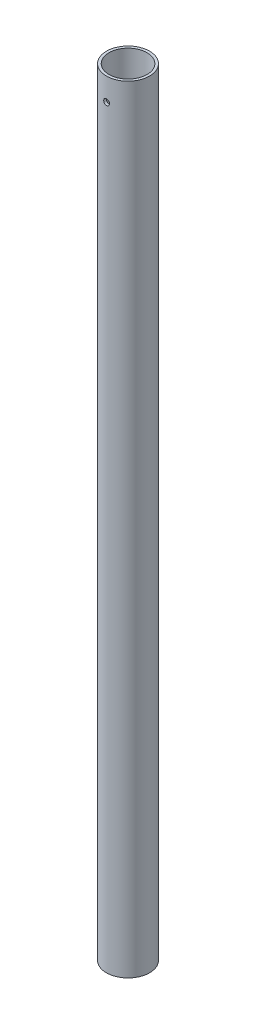
ISO-10303-21;
HEADER;
FILE_DESCRIPTION(('STEP AP214'),'2;1');
FILE_NAME('part.step','',(''),(''),'','','');
FILE_SCHEMA(('AUTOMOTIVE_DESIGN { 1 0 10303 214 1 1 1 1 }'));
ENDSEC;
DATA;
#1=APPLICATION_CONTEXT('core data for automotive mechanical design processes');
#2=APPLICATION_PROTOCOL_DEFINITION('international standard','automotive_design',2000,#1);
#3=PRODUCT_CONTEXT('',#1,'mechanical');
#4=PRODUCT('Part','Part','',(#3));
#5=PRODUCT_RELATED_PRODUCT_CATEGORY('part','',(#4));
#6=PRODUCT_DEFINITION_FORMATION('','',#4);
#7=PRODUCT_DEFINITION_CONTEXT('part definition',#1,'design');
#8=PRODUCT_DEFINITION('design','',#6,#7);
#9=PRODUCT_DEFINITION_SHAPE('','',#8);
#10=(LENGTH_UNIT() NAMED_UNIT(*) SI_UNIT(.MILLI.,.METRE.));
#11=(NAMED_UNIT(*) PLANE_ANGLE_UNIT() SI_UNIT($,.RADIAN.));
#12=(NAMED_UNIT(*) SI_UNIT($,.STERADIAN.) SOLID_ANGLE_UNIT());
#13=UNCERTAINTY_MEASURE_WITH_UNIT(LENGTH_MEASURE(1.E-05),#10,'distance_accuracy_value','');
#14=(GEOMETRIC_REPRESENTATION_CONTEXT(3) GLOBAL_UNCERTAINTY_ASSIGNED_CONTEXT((#13)) GLOBAL_UNIT_ASSIGNED_CONTEXT((#10,
#11,#12)) REPRESENTATION_CONTEXT('',''));
#15=CARTESIAN_POINT('',(0.,0.,0.));
#16=DIRECTION('',(0.,0.,1.));
#17=DIRECTION('',(1.,0.,0.));
#18=AXIS2_PLACEMENT_3D('',#15,#16,#17);
#19=CARTESIAN_POINT('',(0.,914.4,0.));
#20=DIRECTION('',(0.,-1.,0.));
#21=DIRECTION('',(0.,0.,-1.));
#22=AXIS2_PLACEMENT_3D('',#19,#20,#21);
#23=CYLINDRICAL_SURFACE('',#22,22.352);
#24=CARTESIAN_POINT('',(0.,0.,0.));
#25=DIRECTION('',(0.,-1.,0.));
#26=DIRECTION('',(0.,0.,-1.));
#27=AXIS2_PLACEMENT_3D('',#24,#25,#26);
#28=CIRCLE('',#27,22.352);
#29=CARTESIAN_POINT('',(0.,0.,-22.352));
#30=VERTEX_POINT('',#29);
#31=EDGE_CURVE('E58',#30,#30,#28,.T.);
#32=ORIENTED_EDGE('',*,*,#31,.T.);
#33=EDGE_LOOP('',(#32));
#34=FACE_BOUND('',#33,.T.);
#35=CARTESIAN_POINT('',(0.,891.2352,22.352));
#36=CARTESIAN_POINT('',(-0.192787800331613,891.235191670226,22.3519966817372));
#37=CARTESIAN_POINT('',(-0.385696921882685,891.219005278297,22.3494794771306));
#38=CARTESIAN_POINT('',(-0.766131020378442,891.154702321744,22.3396792596899));
#39=CARTESIAN_POINT('',(-0.95365010288195,891.106552091801,22.3323912221772));
#40=CARTESIAN_POINT('',(-1.31772767558845,890.979797747822,22.3138679603751));
#41=CARTESIAN_POINT('',(-1.49429473284724,890.901217794604,22.3026358682736));
#42=CARTESIAN_POINT('',(-1.83170153364577,890.715897565234,22.2774646791974));
#43=CARTESIAN_POINT('',(-1.99254418053206,890.609162501138,22.2635260833747));
#44=CARTESIAN_POINT('',(-2.2952912959751,890.369631083722,22.2343624585199));
#45=CARTESIAN_POINT('',(-2.43704860919259,890.236649784972,22.2191287642589));
#46=CARTESIAN_POINT('',(-2.69636219266557,889.948759356853,22.1891554805789));
#47=CARTESIAN_POINT('',(-2.81391175083711,889.793844165913,22.1744160291445));
#48=CARTESIAN_POINT('',(-3.02205947251266,889.465452233072,22.1470128358336));
#49=CARTESIAN_POINT('',(-3.11250089132633,889.291875137706,22.1343613490768));
#50=CARTESIAN_POINT('',(-3.26279668694624,888.931885333036,22.1127085726575));
#51=CARTESIAN_POINT('',(-3.3226854046329,888.745487303036,22.1037031871805));
#52=CARTESIAN_POINT('',(-3.3956301059032,888.428539200665,22.0925875651964));
#53=CARTESIAN_POINT('',(-3.41763647502503,888.300023006714,22.0891803484933));
#54=CARTESIAN_POINT('',(-3.44702415621325,888.041289669816,22.0846133585234));
#55=CARTESIAN_POINT('',(-3.45440563819527,887.911072546649,22.0834535591455));
#56=CARTESIAN_POINT('',(-3.4543916568152,887.588027689371,22.083459372483));
#57=CARTESIAN_POINT('',(-3.43820777823989,887.395134018256,22.086007580993));
#58=CARTESIAN_POINT('',(-3.37391571400562,887.014732032398,22.0959184684352));
#59=CARTESIAN_POINT('',(-3.32577381014417,886.827229624085,22.103286232253));
#60=CARTESIAN_POINT('',(-3.19904381395493,886.463187323993,22.1219822351445));
#61=CARTESIAN_POINT('',(-3.12048027431732,886.286638724594,22.1333072796588));
#62=CARTESIAN_POINT('',(-2.93519871600419,885.949262942106,22.1586374506396));
#63=CARTESIAN_POINT('',(-2.82848586996744,885.788432878056,22.1726420845823));
#64=CARTESIAN_POINT('',(-2.58897705366211,885.485671934179,22.2018856503502));
#65=CARTESIAN_POINT('',(-2.45599116183172,885.343892106742,22.2171330642284));
#66=CARTESIAN_POINT('',(-2.16808204690628,885.084534956294,22.2470723479777));
#67=CARTESIAN_POINT('',(-2.01315282192278,884.966964276573,22.2617640644582));
#68=CARTESIAN_POINT('',(-1.68474825740002,884.75879419673,22.2890287927131));
#69=CARTESIAN_POINT('',(-1.51117498187741,884.668347734429,22.3015896233344));
#70=CARTESIAN_POINT('',(-1.15119343144948,884.518041522809,22.3230606357152));
#71=CARTESIAN_POINT('',(-0.96479980232436,884.458147508401,22.3319749049221));
#72=CARTESIAN_POINT('',(-0.647837597429979,884.38518784625,22.3429724921967));
#73=CARTESIAN_POINT('',(-0.519301668870918,884.363174711376,22.3463414072399));
#74=CARTESIAN_POINT('',(-0.260528952017654,884.333778054954,22.3508562700568));
#75=CARTESIAN_POINT('',(-0.130292182682782,884.326394370472,22.3520022425885));
#76=CARTESIAN_POINT('',(0.192787800331615,884.326408329774,22.3519966817372));
#77=CARTESIAN_POINT('',(0.385696921882688,884.342594721703,22.3494794771306));
#78=CARTESIAN_POINT('',(0.766131020378447,884.406897678256,22.3396792596899));
#79=CARTESIAN_POINT('',(0.953650102881956,884.455047908199,22.3323912221772));
#80=CARTESIAN_POINT('',(1.31772767558846,884.581802252178,22.3138679603751));
#81=CARTESIAN_POINT('',(1.49429473284724,884.660382205397,22.3026358682736));
#82=CARTESIAN_POINT('',(1.83170153364578,884.845702434766,22.2774646791974));
#83=CARTESIAN_POINT('',(1.99254418053206,884.952437498863,22.2635260833747));
#84=CARTESIAN_POINT('',(2.29529129597509,885.191968916279,22.2343624585199));
#85=CARTESIAN_POINT('',(2.43704860919259,885.324950215028,22.2191287642589));
#86=CARTESIAN_POINT('',(2.69636219266557,885.612840643147,22.1891554805789));
#87=CARTESIAN_POINT('',(2.81391175083711,885.767755834087,22.1744160291445));
#88=CARTESIAN_POINT('',(3.02205947251267,886.096147766929,22.1470128358336));
#89=CARTESIAN_POINT('',(3.11250089132636,886.269724862294,22.1343613490768));
#90=CARTESIAN_POINT('',(3.26279668694625,886.629714666964,22.1127085726575));
#91=CARTESIAN_POINT('',(3.3226854046329,886.816112696965,22.1037031871805));
#92=CARTESIAN_POINT('',(3.39563010590318,887.133060799336,22.0925875651964));
#93=CARTESIAN_POINT('',(3.417636475025,887.261576993287,22.0891803484933));
#94=CARTESIAN_POINT('',(3.44702415621323,887.520310330184,22.0846133585234));
#95=CARTESIAN_POINT('',(3.45440563819526,887.650527453351,22.0834535591455));
#96=CARTESIAN_POINT('',(3.45439165681519,887.97357231063,22.083459372483));
#97=CARTESIAN_POINT('',(3.43820777823988,888.166465981744,22.086007580993));
#98=CARTESIAN_POINT('',(3.37391571400561,888.546867967603,22.0959184684352));
#99=CARTESIAN_POINT('',(3.32577381014417,888.734370375915,22.103286232253));
#100=CARTESIAN_POINT('',(3.1990438139549,889.098412676007,22.1219822351445));
#101=CARTESIAN_POINT('',(3.12048027431725,889.274961275407,22.1333072796588));
#102=CARTESIAN_POINT('',(2.9351987160041,889.612337057895,22.1586374506396));
#103=CARTESIAN_POINT('',(2.8284858699674,889.773167121944,22.1726420845823));
#104=CARTESIAN_POINT('',(2.58897705366211,890.075928065821,22.2018856503502));
#105=CARTESIAN_POINT('',(2.45599116183171,890.217707893258,22.2171330642284));
#106=CARTESIAN_POINT('',(2.16808204690627,890.477065043706,22.2470723479777));
#107=CARTESIAN_POINT('',(2.01315282192277,890.594635723427,22.2617640644582));
#108=CARTESIAN_POINT('',(1.68474825740001,890.802805803271,22.2890287927131));
#109=CARTESIAN_POINT('',(1.51117498187741,890.893252265571,22.3015896233344));
#110=CARTESIAN_POINT('',(1.15119343144947,891.043558477191,22.3230606357152));
#111=CARTESIAN_POINT('',(0.964799802324353,891.103452491599,22.3319749049221));
#112=CARTESIAN_POINT('',(0.647837597429972,891.17641215375,22.3429724921967));
#113=CARTESIAN_POINT('',(0.519301668870912,891.198425288625,22.3463414072399));
#114=CARTESIAN_POINT('',(0.260528952017652,891.227821945046,22.3508562700568));
#115=CARTESIAN_POINT('',(0.130292182682782,891.235205629529,22.3520022425885));
#116=CARTESIAN_POINT('',(0.,891.2352,22.352));
#117=B_SPLINE_CURVE_WITH_KNOTS('',3,(#35,#36,#37,#38,#39,#40,#41,#42,#43,#44,#45,#46,#47,#48,
#49,#50,#51,#52,#53,#54,#55,#56,#57,#58,#59,#60,#61,#62,#63,#64,#65,#66,#67,#68,#69,#70,#71,#72,
#73,#74,#75,#76,#77,#78,#79,#80,#81,#82,#83,#84,#85,#86,#87,#88,#89,#90,#91,#92,#93,#94,#95,#96,
#97,#98,#99,#100,#101,#102,#103,#104,#105,#106,#107,#108,#109,#110,#111,#112,#113,#114,#115,
#116),.UNSPECIFIED.,.T.,.F.,(4,2,2,2,2,2,2,2,2,2,2,2,2,2,2,2,2,2,2,2,2,2,2,2,2,2,2,2,2,2,2,2,2,
2,2,2,2,2,2,2,4),(0.,0.577885934660606,1.15638148469218,1.73441865517966,2.31234889482481,
2.89450712845753,3.47682656041288,4.06245085625192,4.6474154588892,5.0379149199601,
5.42840984408317,6.00624923349245,6.58469925945742,7.16268339984174,7.74056140535436,
8.32278059459881,8.90515933969419,9.49076257833453,10.0757076010334,10.4662658118655,
10.8568196728416,11.4347056075022,12.0132011575338,12.5912383280213,13.1691685676664,
13.7513268012991,14.3336462332545,14.9192705290936,15.5042351317308,15.8947345928015,
16.2852295169248,16.863068906334,17.441518932299,18.0195030726835,18.597381078196,
19.1796002674404,19.7619790125358,20.3475822511761,20.932527273875,21.3230854847071,
21.7136393456832),.UNSPECIFIED.);
#118=CARTESIAN_POINT('',(0.,891.2352,22.352));
#119=VERTEX_POINT('',#118);
#120=EDGE_CURVE('E61',#119,#119,#117,.T.);
#121=ORIENTED_EDGE('',*,*,#120,.T.);
#122=EDGE_LOOP('',(#121));
#123=FACE_BOUND('',#122,.T.);
#124=CARTESIAN_POINT('',(0.,914.4,0.));
#125=DIRECTION('',(0.,-1.,0.));
#126=DIRECTION('',(0.,0.,-1.));
#127=AXIS2_PLACEMENT_3D('',#124,#125,#126);
#128=CIRCLE('',#127,22.352);
#129=CARTESIAN_POINT('',(0.,914.4,-22.352));
#130=VERTEX_POINT('',#129);
#131=EDGE_CURVE('E19',#130,#130,#128,.T.);
#132=ORIENTED_EDGE('',*,*,#131,.F.);
#133=EDGE_LOOP('',(#132));
#134=FACE_BOUND('',#133,.T.);
#135=ADVANCED_FACE('F15',(#34,#123,#134),#23,.F.);
#136=CARTESIAN_POINT('',(0.,914.4,0.));
#137=DIRECTION('',(0.,1.,0.));
#138=DIRECTION('',(0.,0.,1.));
#139=AXIS2_PLACEMENT_3D('',#136,#137,#138);
#140=PLANE('',#139);
#141=ORIENTED_EDGE('',*,*,#131,.T.);
#142=EDGE_LOOP('',(#141));
#143=FACE_BOUND('',#142,.T.);
#144=CARTESIAN_POINT('',(0.,914.4,0.));
#145=DIRECTION('',(0.,-1.,0.));
#146=DIRECTION('',(0.,0.,-1.));
#147=AXIS2_PLACEMENT_3D('',#144,#145,#146);
#148=CIRCLE('',#147,25.4);
#149=CARTESIAN_POINT('',(0.,914.4,-25.4));
#150=VERTEX_POINT('',#149);
#151=EDGE_CURVE('E31',#150,#150,#148,.T.);
#152=ORIENTED_EDGE('',*,*,#151,.F.);
#153=EDGE_LOOP('',(#152));
#154=FACE_BOUND('',#153,.T.);
#155=ADVANCED_FACE('F53',(#143,#154),#140,.T.);
#156=CARTESIAN_POINT('',(0.,887.7808,25.4));
#157=DIRECTION('',(0.,0.,1.));
#158=DIRECTION('',(1.,0.,0.));
#159=AXIS2_PLACEMENT_3D('',#156,#157,#158);
#160=CYLINDRICAL_SURFACE('',#159,3.45439999999999);
#161=CARTESIAN_POINT('',(0.,891.2352,25.4));
#162=CARTESIAN_POINT('',(0.193070991626469,891.235191678297,25.3999970474551));
#163=CARTESIAN_POINT('',(0.386264952315746,891.218958282941,25.3977753662606));
#164=CARTESIAN_POINT('',(0.767273817455003,891.154459820273,25.3891259816608));
#165=CARTESIAN_POINT('',(0.955082765992925,891.106160612932,25.382693795491));
#166=CARTESIAN_POINT('',(1.31974398132526,890.978987558625,25.366347212944));
#167=CARTESIAN_POINT('',(1.49660394000768,890.90013546498,25.3564352945688));
#168=CARTESIAN_POINT('',(1.83454236707043,890.714148379322,25.3342291740202));
#169=CARTESIAN_POINT('',(1.99562400971707,890.607019092177,25.3219354525037));
#170=CARTESIAN_POINT('',(2.29850241554909,890.366789041464,25.2962478358809));
#171=CARTESIAN_POINT('',(2.44018414023283,890.233543860395,25.2828480746109));
#172=CARTESIAN_POINT('',(2.69928078373563,889.945135057683,25.2565019442347));
#173=CARTESIAN_POINT('',(2.81668907656898,889.789965470682,25.2435556997251));
#174=CARTESIAN_POINT('',(3.02435225953871,889.461316683899,25.2195222547393));
#175=CARTESIAN_POINT('',(3.11448416378959,889.287759182193,25.2084435713536));
#176=CARTESIAN_POINT('',(3.26418388210955,888.927915334548,25.1894987857853));
#177=CARTESIAN_POINT('',(3.32378584713353,888.741643476552,25.1816290960245));
#178=CARTESIAN_POINT('',(3.39619703780228,888.425435694461,25.1719417173603));
#179=CARTESIAN_POINT('',(3.41799184882557,888.297520117343,25.1689799149904));
#180=CARTESIAN_POINT('',(3.44709606337108,888.040021502767,25.1650102706662));
#181=CARTESIAN_POINT('',(3.45440559335475,887.910438479876,25.1640024116535));
#182=CARTESIAN_POINT('',(3.45439167020075,887.587738312045,25.1640075192213));
#183=CARTESIAN_POINT('',(3.43815978668365,887.394553631033,25.1662503653721));
#184=CARTESIAN_POINT('',(3.37366787606902,887.013564050969,25.1749753229591));
#185=CARTESIAN_POINT('',(3.32537367722131,886.825765115017,25.1814619572821));
#186=CARTESIAN_POINT('',(3.1982152707688,886.461125075995,25.1979265589886));
#187=CARTESIAN_POINT('',(3.11937305296814,886.28427619656,25.207902014464));
#188=CARTESIAN_POINT('',(2.93340923155659,885.94635636824,25.230216771276));
#189=CARTESIAN_POINT('',(2.82629330901601,885.785282258616,25.2425555976012));
#190=CARTESIAN_POINT('',(2.58607681716738,885.482395489634,25.268297193112));
#191=CARTESIAN_POINT('',(2.45282884006024,885.340700221653,25.2817057292604));
#192=CARTESIAN_POINT('',(2.16440874127488,885.081577395202,25.3080275878553));
#193=CARTESIAN_POINT('',(2.0092306900005,884.964156421391,25.3209407751617));
#194=CARTESIAN_POINT('',(1.68057437086647,884.756479884583,25.3448794485981));
#195=CARTESIAN_POINT('',(1.50701925900727,884.666345003099,25.3558964582949));
#196=CARTESIAN_POINT('',(1.14718058019931,884.516639097399,25.3747178048955));
#197=CARTESIAN_POINT('',(0.960911481179349,884.457033967801,25.3825257248003));
#198=CARTESIAN_POINT('',(0.644695253214913,884.38461377507,25.3921331622496));
#199=CARTESIAN_POINT('',(0.516767735407957,884.362814889431,25.3950690620572));
#200=CARTESIAN_POINT('',(0.259245285997427,884.333705269036,25.3990034640872));
#201=CARTESIAN_POINT('',(0.129650368494713,884.326394411839,25.4000019826828));
#202=CARTESIAN_POINT('',(-0.193070991626449,884.326408321704,25.3999970474551));
#203=CARTESIAN_POINT('',(-0.386264952315729,884.342641717059,25.3977753662606));
#204=CARTESIAN_POINT('',(-0.767273817454991,884.407140179727,25.3891259816608));
#205=CARTESIAN_POINT('',(-0.955082765992915,884.455439387068,25.382693795491));
#206=CARTESIAN_POINT('',(-1.31974398132526,884.582612441375,25.366347212944));
#207=CARTESIAN_POINT('',(-1.49660394000768,884.661464535021,25.3564352945688));
#208=CARTESIAN_POINT('',(-1.83454236707043,884.847451620678,25.3342291740202));
#209=CARTESIAN_POINT('',(-1.99562400971707,884.954580907823,25.3219354525037));
#210=CARTESIAN_POINT('',(-2.29850241554909,885.194810958536,25.2962478358809));
#211=CARTESIAN_POINT('',(-2.44018414023284,885.328056139605,25.2828480746109));
#212=CARTESIAN_POINT('',(-2.69928078373563,885.616464942318,25.2565019442347));
#213=CARTESIAN_POINT('',(-2.81668907656898,885.771634529318,25.2435556997251));
#214=CARTESIAN_POINT('',(-3.02435225953873,886.100283316101,25.2195222547393));
#215=CARTESIAN_POINT('',(-3.11448416378963,886.273840817807,25.2084435713536));
#216=CARTESIAN_POINT('',(-3.26418388210958,886.633684665452,25.1894987857853));
#217=CARTESIAN_POINT('',(-3.32378584713355,886.819956523449,25.1816290960245));
#218=CARTESIAN_POINT('',(-3.39619703780229,887.13616430554,25.1719417173603));
#219=CARTESIAN_POINT('',(-3.41799184882558,887.264079882657,25.1689799149904));
#220=CARTESIAN_POINT('',(-3.44709606337109,887.521578497233,25.1650102706662));
#221=CARTESIAN_POINT('',(-3.45440559335475,887.651161520124,25.1640024116535));
#222=CARTESIAN_POINT('',(-3.45439167020076,887.973861687955,25.1640075192213));
#223=CARTESIAN_POINT('',(-3.43815978668364,888.167046368967,25.1662503653721));
#224=CARTESIAN_POINT('',(-3.37366787606899,888.548035949031,25.1749753229591));
#225=CARTESIAN_POINT('',(-3.32537367722129,888.735834884984,25.1814619572821));
#226=CARTESIAN_POINT('',(-3.19821527076881,889.100474924006,25.1979265589886));
#227=CARTESIAN_POINT('',(-3.11937305296815,889.27732380344,25.207902014464));
#228=CARTESIAN_POINT('',(-2.9334092315566,889.61524363176,25.230216771276));
#229=CARTESIAN_POINT('',(-2.82629330901603,889.776317741384,25.2425555976012));
#230=CARTESIAN_POINT('',(-2.58607681716741,890.079204510367,25.268297193112));
#231=CARTESIAN_POINT('',(-2.45282884006027,890.220899778347,25.2817057292604));
#232=CARTESIAN_POINT('',(-2.16440874127492,890.480022604798,25.3080275878553));
#233=CARTESIAN_POINT('',(-2.00923069000053,890.597443578609,25.3209407751617));
#234=CARTESIAN_POINT('',(-1.68057437086649,890.805120115418,25.3448794485981));
#235=CARTESIAN_POINT('',(-1.50701925900727,890.895254996901,25.3558964582949));
#236=CARTESIAN_POINT('',(-1.14718058019932,891.044960902602,25.3747178048955));
#237=CARTESIAN_POINT('',(-0.960911481179356,891.1045660322,25.3825257248003));
#238=CARTESIAN_POINT('',(-0.644695253214913,891.17698622493,25.3921331622496));
#239=CARTESIAN_POINT('',(-0.516767735407947,891.198785110569,25.3950690620572));
#240=CARTESIAN_POINT('',(-0.259245285997406,891.227894730964,25.3990034640872));
#241=CARTESIAN_POINT('',(-0.12965036849469,891.235205588162,25.4000019826828));
#242=CARTESIAN_POINT('',(0.,891.2352,25.4));
#243=B_SPLINE_CURVE_WITH_KNOTS('',3,(#161,#162,#163,#164,#165,#166,#167,#168,#169,#170,#171,
#172,#173,#174,#175,#176,#177,#178,#179,#180,#181,#182,#183,#184,#185,#186,#187,#188,#189,#190,
#191,#192,#193,#194,#195,#196,#197,#198,#199,#200,#201,#202,#203,#204,#205,#206,#207,#208,#209,
#210,#211,#212,#213,#214,#215,#216,#217,#218,#219,#220,#221,#222,#223,#224,#225,#226,#227,#228,
#229,#230,#231,#232,#233,#234,#235,#236,#237,#238,#239,#240,#241,#242),.UNSPECIFIED.,.T.,.F.,(4,
2,2,2,2,2,2,2,2,2,2,2,2,2,2,2,2,2,2,2,2,2,2,2,2,2,2,2,2,2,2,2,2,2,2,2,2,2,2,2,4),(0.,
0.578738621952065,1.15809440922967,1.73703845726185,2.31586579364161,2.89798918850561,
3.48027127800135,4.0651409764764,4.64935499993448,5.0379552801622,5.42655216776179,
6.00526283395967,6.58459127748487,7.16350346744754,7.74229942430228,8.32445942134516,
8.90677712883579,9.49163391086042,10.0758359051378,10.4644717592318,10.853104328869,
11.4318429508211,12.0111987380987,12.5901427861309,13.1689701225106,13.7510935173746,
14.3333756068704,14.9182453053455,15.5024593288035,15.8910596090312,16.2796564966308,
16.8583671628289,17.4376956063539,18.0166077963166,18.5954037531713,19.1775637502141,
19.7598814577048,20.3447382397294,20.9289402340068,21.3175760881009,21.7062086577381),.UNSPECIFIED.);
#244=CARTESIAN_POINT('',(0.,891.2352,25.4));
#245=VERTEX_POINT('',#244);
#246=EDGE_CURVE('E24',#245,#245,#243,.T.);
#247=ORIENTED_EDGE('',*,*,#246,.F.);
#248=EDGE_LOOP('',(#247));
#249=FACE_BOUND('',#248,.T.);
#250=ORIENTED_EDGE('',*,*,#120,.F.);
#251=EDGE_LOOP('',(#250));
#252=FACE_BOUND('',#251,.T.);
#253=ADVANCED_FACE('F39',(#249,#252),#160,.F.);
#254=CARTESIAN_POINT('',(0.,0.,0.));
#255=DIRECTION('',(0.,1.,0.));
#256=DIRECTION('',(0.,0.,1.));
#257=AXIS2_PLACEMENT_3D('',#254,#255,#256);
#258=PLANE('',#257);
#259=ORIENTED_EDGE('',*,*,#31,.F.);
#260=EDGE_LOOP('',(#259));
#261=FACE_BOUND('',#260,.T.);
#262=CARTESIAN_POINT('',(0.,0.,0.));
#263=DIRECTION('',(0.,-1.,0.));
#264=DIRECTION('',(0.,0.,-1.));
#265=AXIS2_PLACEMENT_3D('',#262,#263,#264);
#266=CIRCLE('',#265,25.4);
#267=CARTESIAN_POINT('',(0.,0.,-25.4));
#268=VERTEX_POINT('',#267);
#269=EDGE_CURVE('E9',#268,#268,#266,.F.);
#270=ORIENTED_EDGE('',*,*,#269,.F.);
#271=EDGE_LOOP('',(#270));
#272=FACE_BOUND('',#271,.T.);
#273=ADVANCED_FACE('F45',(#261,#272),#258,.F.);
#274=CARTESIAN_POINT('',(0.,914.4,0.));
#275=DIRECTION('',(0.,-1.,0.));
#276=DIRECTION('',(0.,0.,-1.));
#277=AXIS2_PLACEMENT_3D('',#274,#275,#276);
#278=CYLINDRICAL_SURFACE('',#277,25.4);
#279=ORIENTED_EDGE('',*,*,#246,.T.);
#280=EDGE_LOOP('',(#279));
#281=FACE_BOUND('',#280,.T.);
#282=ORIENTED_EDGE('',*,*,#269,.T.);
#283=EDGE_LOOP('',(#282));
#284=FACE_BOUND('',#283,.T.);
#285=ORIENTED_EDGE('',*,*,#151,.T.);
#286=EDGE_LOOP('',(#285));
#287=FACE_BOUND('',#286,.T.);
#288=ADVANCED_FACE('F42',(#281,#284,#287),#278,.T.);
#289=CLOSED_SHELL('',(#135,#155,#253,#273,#288));
#290=MANIFOLD_SOLID_BREP('B1',#289);
#291=ADVANCED_BREP_SHAPE_REPRESENTATION('',(#18,#290),#14);
#292=SHAPE_DEFINITION_REPRESENTATION(#9,#291);
ENDSEC;
END-ISO-10303-21;
